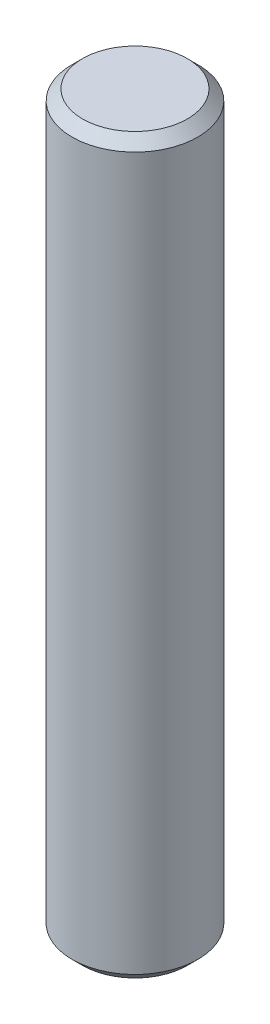
ISO-10303-21;
HEADER;
FILE_DESCRIPTION(('STEP AP214'),'2;1');
FILE_NAME('part.step','',(''),(''),'','','');
FILE_SCHEMA(('AUTOMOTIVE_DESIGN { 1 0 10303 214 1 1 1 1 }'));
ENDSEC;
DATA;
#1=APPLICATION_CONTEXT('core data for automotive mechanical design processes');
#2=APPLICATION_PROTOCOL_DEFINITION('international standard','automotive_design',2000,#1);
#3=PRODUCT_CONTEXT('',#1,'mechanical');
#4=PRODUCT('Part','Part','',(#3));
#5=PRODUCT_RELATED_PRODUCT_CATEGORY('part','',(#4));
#6=PRODUCT_DEFINITION_FORMATION('','',#4);
#7=PRODUCT_DEFINITION_CONTEXT('part definition',#1,'design');
#8=PRODUCT_DEFINITION('design','',#6,#7);
#9=PRODUCT_DEFINITION_SHAPE('','',#8);
#10=(LENGTH_UNIT() NAMED_UNIT(*) SI_UNIT(.MILLI.,.METRE.));
#11=(NAMED_UNIT(*) PLANE_ANGLE_UNIT() SI_UNIT($,.RADIAN.));
#12=(NAMED_UNIT(*) SI_UNIT($,.STERADIAN.) SOLID_ANGLE_UNIT());
#13=UNCERTAINTY_MEASURE_WITH_UNIT(LENGTH_MEASURE(1.E-05),#10,'distance_accuracy_value','');
#14=(GEOMETRIC_REPRESENTATION_CONTEXT(3) GLOBAL_UNCERTAINTY_ASSIGNED_CONTEXT((#13)) GLOBAL_UNIT_ASSIGNED_CONTEXT((#10,
#11,#12)) REPRESENTATION_CONTEXT('',''));
#15=CARTESIAN_POINT('',(0.,0.,0.));
#16=DIRECTION('',(0.,0.,1.));
#17=DIRECTION('',(1.,0.,0.));
#18=AXIS2_PLACEMENT_3D('',#15,#16,#17);
#19=CARTESIAN_POINT('',(0.,35.,0.));
#20=DIRECTION('',(0.,-1.,0.));
#21=DIRECTION('',(0.,0.,-1.));
#22=AXIS2_PLACEMENT_3D('',#19,#20,#21);
#23=CYLINDRICAL_SURFACE('',#22,6.);
#24=CARTESIAN_POINT('',(0.,34.,0.));
#25=DIRECTION('',(0.,1.,0.));
#26=DIRECTION('',(0.,0.,1.));
#27=AXIS2_PLACEMENT_3D('',#24,#25,#26);
#28=CIRCLE('',#27,6.);
#29=CARTESIAN_POINT('',(0.,34.,6.));
#30=VERTEX_POINT('',#29);
#31=EDGE_CURVE('E57',#30,#30,#28,.F.);
#32=ORIENTED_EDGE('',*,*,#31,.T.);
#33=EDGE_LOOP('',(#32));
#34=FACE_BOUND('',#33,.T.);
#35=CARTESIAN_POINT('',(0.,-34.,0.));
#36=DIRECTION('',(0.,1.,0.));
#37=DIRECTION('',(0.,0.,1.));
#38=AXIS2_PLACEMENT_3D('',#35,#36,#37);
#39=CIRCLE('',#38,6.);
#40=CARTESIAN_POINT('',(0.,-34.,6.));
#41=VERTEX_POINT('',#40);
#42=EDGE_CURVE('E61',#41,#41,#39,.T.);
#43=ORIENTED_EDGE('',*,*,#42,.T.);
#44=EDGE_LOOP('',(#43));
#45=FACE_BOUND('',#44,.T.);
#46=ADVANCED_FACE('F49',(#34,#45),#23,.T.);
#47=CARTESIAN_POINT('',(0.,35.,0.));
#48=DIRECTION('',(0.,1.,0.));
#49=DIRECTION('',(0.,0.,1.));
#50=AXIS2_PLACEMENT_3D('',#47,#48,#49);
#51=PLANE('',#50);
#52=CARTESIAN_POINT('',(0.,35.,0.));
#53=DIRECTION('',(0.,1.,0.));
#54=DIRECTION('',(0.,0.,1.));
#55=AXIS2_PLACEMENT_3D('',#52,#53,#54);
#56=CIRCLE('',#55,4.99999999999999);
#57=CARTESIAN_POINT('',(0.,35.,4.99999999999999));
#58=VERTEX_POINT('',#57);
#59=EDGE_CURVE('E65',#58,#58,#56,.T.);
#60=ORIENTED_EDGE('',*,*,#59,.T.);
#61=EDGE_LOOP('',(#60));
#62=FACE_BOUND('',#61,.T.);
#63=ADVANCED_FACE('F71',(#62),#51,.T.);
#64=CARTESIAN_POINT('',(0.,-35.,0.));
#65=DIRECTION('',(0.,1.,0.));
#66=DIRECTION('',(0.,0.,1.));
#67=AXIS2_PLACEMENT_3D('',#64,#65,#66);
#68=PLANE('',#67);
#69=CARTESIAN_POINT('',(0.,-35.,0.));
#70=DIRECTION('',(0.,1.,0.));
#71=DIRECTION('',(0.,0.,1.));
#72=AXIS2_PLACEMENT_3D('',#69,#70,#71);
#73=CIRCLE('',#72,5.);
#74=CARTESIAN_POINT('',(0.,-35.,5.));
#75=VERTEX_POINT('',#74);
#76=EDGE_CURVE('E10',#75,#75,#73,.F.);
#77=ORIENTED_EDGE('',*,*,#76,.T.);
#78=EDGE_LOOP('',(#77));
#79=FACE_BOUND('',#78,.T.);
#80=ADVANCED_FACE('F75',(#79),#68,.F.);
#81=CARTESIAN_POINT('',(0.,35.,0.));
#82=DIRECTION('',(0.,-1.,0.));
#83=DIRECTION('',(0.,0.,-1.));
#84=AXIS2_PLACEMENT_3D('',#81,#82,#83);
#85=CONICAL_SURFACE('',#84,4.99999999999999,0.78539816339745);
#86=ORIENTED_EDGE('',*,*,#31,.F.);
#87=EDGE_LOOP('',(#86));
#88=FACE_BOUND('',#87,.T.);
#89=ORIENTED_EDGE('',*,*,#59,.F.);
#90=EDGE_LOOP('',(#89));
#91=FACE_BOUND('',#90,.T.);
#92=ADVANCED_FACE('F73',(#88,#91),#85,.T.);
#93=CARTESIAN_POINT('',(0.,-34.,0.));
#94=DIRECTION('',(0.,1.,0.));
#95=DIRECTION('',(0.,0.,1.));
#96=AXIS2_PLACEMENT_3D('',#93,#94,#95);
#97=CONICAL_SURFACE('',#96,6.,0.785398163397456);
#98=ORIENTED_EDGE('',*,*,#76,.F.);
#99=EDGE_LOOP('',(#98));
#100=FACE_BOUND('',#99,.T.);
#101=ORIENTED_EDGE('',*,*,#42,.F.);
#102=EDGE_LOOP('',(#101));
#103=FACE_BOUND('',#102,.T.);
#104=ADVANCED_FACE('F52',(#100,#103),#97,.T.);
#105=CLOSED_SHELL('',(#46,#63,#80,#92,#104));
#106=MANIFOLD_SOLID_BREP('B2',#105);
#107=ADVANCED_BREP_SHAPE_REPRESENTATION('',(#18,#106),#14);
#108=SHAPE_DEFINITION_REPRESENTATION(#9,#107);
ENDSEC;
END-ISO-10303-21;
